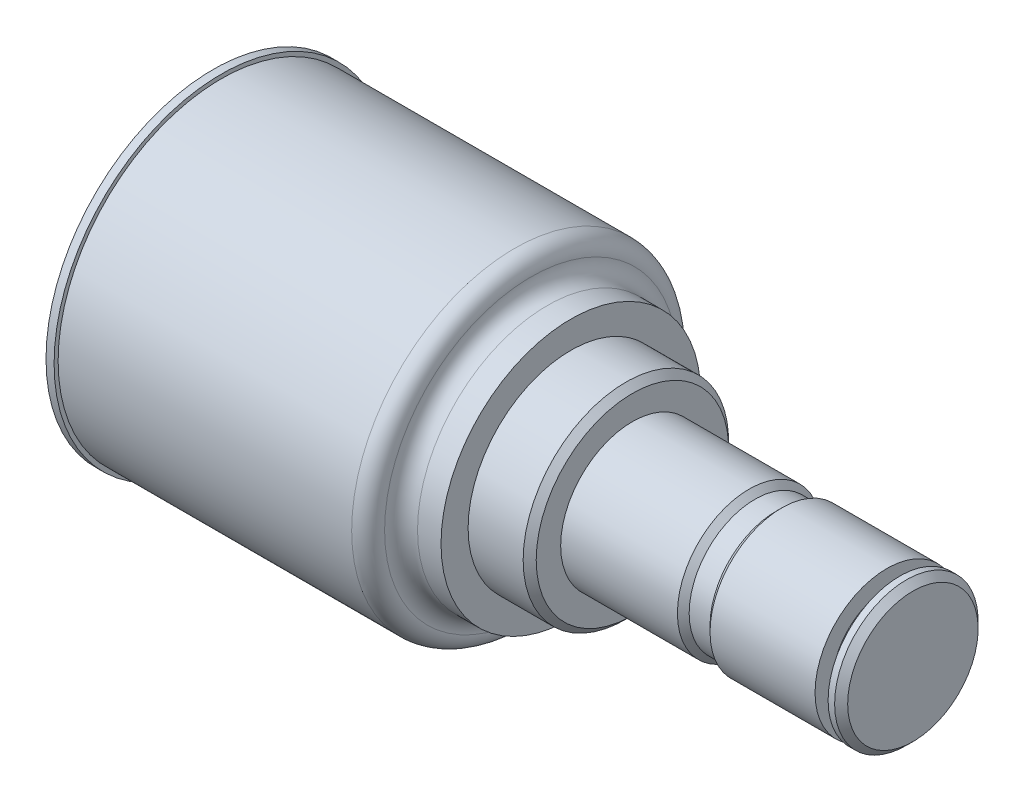
ISO-10303-21;
HEADER;
FILE_DESCRIPTION(('STEP AP214'),'2;1');
FILE_NAME('part.step','',(''),(''),'','','');
FILE_SCHEMA(('AUTOMOTIVE_DESIGN { 1 0 10303 214 1 1 1 1 }'));
ENDSEC;
DATA;
#1=APPLICATION_CONTEXT('core data for automotive mechanical design processes');
#2=APPLICATION_PROTOCOL_DEFINITION('international standard','automotive_design',2000,#1);
#3=PRODUCT_CONTEXT('',#1,'mechanical');
#4=PRODUCT('Part','Part','',(#3));
#5=PRODUCT_RELATED_PRODUCT_CATEGORY('part','',(#4));
#6=PRODUCT_DEFINITION_FORMATION('','',#4);
#7=PRODUCT_DEFINITION_CONTEXT('part definition',#1,'design');
#8=PRODUCT_DEFINITION('design','',#6,#7);
#9=PRODUCT_DEFINITION_SHAPE('','',#8);
#10=(LENGTH_UNIT() NAMED_UNIT(*) SI_UNIT(.MILLI.,.METRE.));
#11=(NAMED_UNIT(*) PLANE_ANGLE_UNIT() SI_UNIT($,.RADIAN.));
#12=(NAMED_UNIT(*) SI_UNIT($,.STERADIAN.) SOLID_ANGLE_UNIT());
#13=UNCERTAINTY_MEASURE_WITH_UNIT(LENGTH_MEASURE(1.E-05),#10,'distance_accuracy_value','');
#14=(GEOMETRIC_REPRESENTATION_CONTEXT(3) GLOBAL_UNCERTAINTY_ASSIGNED_CONTEXT((#13)) GLOBAL_UNIT_ASSIGNED_CONTEXT((#10,
#11,#12)) REPRESENTATION_CONTEXT('',''));
#15=CARTESIAN_POINT('',(0.,0.,0.));
#16=DIRECTION('',(0.,0.,1.));
#17=DIRECTION('',(1.,0.,0.));
#18=AXIS2_PLACEMENT_3D('',#15,#16,#17);
#19=CARTESIAN_POINT('',(136.2456,13.9700000000018,-2.22044604925031E-13));
#20=DIRECTION('',(-1.,0.,0.));
#21=DIRECTION('',(0.,0.,1.));
#22=AXIS2_PLACEMENT_3D('',#19,#20,#21);
#23=PLANE('',#22);
#24=CARTESIAN_POINT('',(136.2456,8.88178419700125E-13,0.));
#25=DIRECTION('',(-1.,0.,0.));
#26=DIRECTION('',(0.,0.,1.));
#27=AXIS2_PLACEMENT_3D('',#24,#25,#26);
#28=CIRCLE('',#27,12.7);
#29=CARTESIAN_POINT('',(136.2456,8.86768436458851E-13,12.7));
#30=VERTEX_POINT('',#29);
#31=EDGE_CURVE('E44',#30,#30,#28,.F.);
#32=ORIENTED_EDGE('',*,*,#31,.T.);
#33=EDGE_LOOP('',(#32));
#34=FACE_BOUND('',#33,.T.);
#35=ADVANCED_FACE('F33',(#34),#23,.F.);
#36=CARTESIAN_POINT('',(-9.33940457714594,-8.88178419700125E-13,0.));
#37=DIRECTION('',(-1.,0.,0.));
#38=DIRECTION('',(0.,0.,1.));
#39=AXIS2_PLACEMENT_3D('',#36,#37,#38);
#40=CYLINDRICAL_SURFACE('',#39,13.97);
#41=CARTESIAN_POINT('',(134.9756,0.,0.));
#42=DIRECTION('',(-1.,0.,0.));
#43=DIRECTION('',(0.,0.,1.));
#44=AXIS2_PLACEMENT_3D('',#41,#42,#43);
#45=CIRCLE('',#44,13.97);
#46=CARTESIAN_POINT('',(134.9756,0.,13.97));
#47=VERTEX_POINT('',#46);
#48=EDGE_CURVE('E48',#47,#47,#45,.T.);
#49=ORIENTED_EDGE('',*,*,#48,.T.);
#50=EDGE_LOOP('',(#49));
#51=FACE_BOUND('',#50,.T.);
#52=CARTESIAN_POINT('',(133.7056,0.,0.));
#53=DIRECTION('',(-1.,0.,0.));
#54=DIRECTION('',(0.,0.,1.));
#55=AXIS2_PLACEMENT_3D('',#52,#53,#54);
#56=CIRCLE('',#55,13.97);
#57=CARTESIAN_POINT('',(133.7056,0.,13.97));
#58=VERTEX_POINT('',#57);
#59=EDGE_CURVE('E53',#58,#58,#56,.T.);
#60=ORIENTED_EDGE('',*,*,#59,.F.);
#61=EDGE_LOOP('',(#60));
#62=FACE_BOUND('',#61,.T.);
#63=ADVANCED_FACE('F159',(#51,#62),#40,.T.);
#64=CARTESIAN_POINT('',(133.7056,10.5918000000003,4.44089209850063E-13));
#65=DIRECTION('',(1.,0.,0.));
#66=DIRECTION('',(0.,0.,-1.));
#67=AXIS2_PLACEMENT_3D('',#64,#65,#66);
#68=PLANE('',#67);
#69=CARTESIAN_POINT('',(133.7056,0.,0.));
#70=DIRECTION('',(-1.,0.,0.));
#71=DIRECTION('',(0.,0.,1.));
#72=AXIS2_PLACEMENT_3D('',#69,#70,#71);
#73=CIRCLE('',#72,10.5918);
#74=CARTESIAN_POINT('',(133.7056,0.,10.5918));
#75=VERTEX_POINT('',#74);
#76=EDGE_CURVE('E56',#75,#75,#73,.T.);
#77=ORIENTED_EDGE('',*,*,#76,.F.);
#78=EDGE_LOOP('',(#77));
#79=FACE_BOUND('',#78,.T.);
#80=ORIENTED_EDGE('',*,*,#59,.T.);
#81=EDGE_LOOP('',(#80));
#82=FACE_BOUND('',#81,.T.);
#83=ADVANCED_FACE('F165',(#79,#82),#68,.F.);
#84=CARTESIAN_POINT('',(-9.33940457714594,-8.88178419700125E-13,0.));
#85=DIRECTION('',(-1.,0.,0.));
#86=DIRECTION('',(0.,0.,1.));
#87=AXIS2_PLACEMENT_3D('',#84,#85,#86);
#88=CYLINDRICAL_SURFACE('',#87,10.5918);
#89=CARTESIAN_POINT('',(131.1656,0.,0.));
#90=DIRECTION('',(-1.,0.,0.));
#91=DIRECTION('',(0.,0.,1.));
#92=AXIS2_PLACEMENT_3D('',#89,#90,#91);
#93=CIRCLE('',#92,10.5918);
#94=CARTESIAN_POINT('',(131.1656,0.,10.5918));
#95=VERTEX_POINT('',#94);
#96=EDGE_CURVE('E59',#95,#95,#93,.T.);
#97=ORIENTED_EDGE('',*,*,#96,.F.);
#98=EDGE_LOOP('',(#97));
#99=FACE_BOUND('',#98,.T.);
#100=ORIENTED_EDGE('',*,*,#76,.T.);
#101=EDGE_LOOP('',(#100));
#102=FACE_BOUND('',#101,.T.);
#103=ADVANCED_FACE('F185',(#99,#102),#88,.T.);
#104=CARTESIAN_POINT('',(131.1656,13.9699999999991,-2.22044604925031E-13));
#105=DIRECTION('',(-1.,0.,0.));
#106=DIRECTION('',(0.,0.,1.));
#107=AXIS2_PLACEMENT_3D('',#104,#105,#106);
#108=PLANE('',#107);
#109=CARTESIAN_POINT('',(131.1656,0.,0.));
#110=DIRECTION('',(-1.,0.,0.));
#111=DIRECTION('',(0.,0.,1.));
#112=AXIS2_PLACEMENT_3D('',#109,#110,#111);
#113=CIRCLE('',#112,13.97);
#114=CARTESIAN_POINT('',(131.1656,0.,13.97));
#115=VERTEX_POINT('',#114);
#116=EDGE_CURVE('E62',#115,#115,#113,.T.);
#117=ORIENTED_EDGE('',*,*,#116,.F.);
#118=EDGE_LOOP('',(#117));
#119=FACE_BOUND('',#118,.T.);
#120=ORIENTED_EDGE('',*,*,#96,.T.);
#121=EDGE_LOOP('',(#120));
#122=FACE_BOUND('',#121,.T.);
#123=ADVANCED_FACE('F190',(#119,#122),#108,.F.);
#124=CARTESIAN_POINT('',(-9.33940457714594,-8.88178419700125E-13,0.));
#125=DIRECTION('',(-1.,0.,0.));
#126=DIRECTION('',(0.,0.,1.));
#127=AXIS2_PLACEMENT_3D('',#124,#125,#126);
#128=CYLINDRICAL_SURFACE('',#127,13.97);
#129=CARTESIAN_POINT('',(110.7186,0.,-4.44089209850063E-13));
#130=DIRECTION('',(-1.,0.,0.));
#131=DIRECTION('',(0.,0.,1.));
#132=AXIS2_PLACEMENT_3D('',#129,#130,#131);
#133=CIRCLE('',#132,13.97);
#134=CARTESIAN_POINT('',(110.7186,0.,13.9699999999996));
#135=VERTEX_POINT('',#134);
#136=EDGE_CURVE('E65',#135,#135,#133,.T.);
#137=ORIENTED_EDGE('',*,*,#136,.F.);
#138=EDGE_LOOP('',(#137));
#139=FACE_BOUND('',#138,.T.);
#140=ORIENTED_EDGE('',*,*,#116,.T.);
#141=EDGE_LOOP('',(#140));
#142=FACE_BOUND('',#141,.T.);
#143=ADVANCED_FACE('F197',(#139,#142),#128,.T.);
#144=CARTESIAN_POINT('',(110.7186,0.,-4.44089209850063E-13));
#145=DIRECTION('',(1.,0.,0.));
#146=DIRECTION('',(0.,0.,-1.));
#147=AXIS2_PLACEMENT_3D('',#144,#145,#146);
#148=CONICAL_SURFACE('',#147,13.97,0.785398163397447);
#149=CARTESIAN_POINT('',(109.5756,0.,-4.44089209850063E-13));
#150=DIRECTION('',(-1.,0.,0.));
#151=DIRECTION('',(0.,0.,1.));
#152=AXIS2_PLACEMENT_3D('',#149,#150,#151);
#153=CIRCLE('',#152,12.827);
#154=CARTESIAN_POINT('',(109.5756,0.,12.8269999999996));
#155=VERTEX_POINT('',#154);
#156=EDGE_CURVE('E68',#155,#155,#153,.T.);
#157=ORIENTED_EDGE('',*,*,#156,.F.);
#158=EDGE_LOOP('',(#157));
#159=FACE_BOUND('',#158,.T.);
#160=ORIENTED_EDGE('',*,*,#136,.T.);
#161=EDGE_LOOP('',(#160));
#162=FACE_BOUND('',#161,.T.);
#163=ADVANCED_FACE('F201',(#159,#162),#148,.T.);
#164=CARTESIAN_POINT('',(-9.33940457714594,-8.88178419700125E-13,0.));
#165=DIRECTION('',(-1.,0.,0.));
#166=DIRECTION('',(0.,0.,1.));
#167=AXIS2_PLACEMENT_3D('',#164,#165,#166);
#168=CYLINDRICAL_SURFACE('',#167,12.827);
#169=CARTESIAN_POINT('',(105.5116,4.44089209850063E-13,-2.22044604925031E-13));
#170=DIRECTION('',(-1.,0.,0.));
#171=DIRECTION('',(0.,0.,1.));
#172=AXIS2_PLACEMENT_3D('',#169,#170,#171);
#173=CIRCLE('',#172,12.827);
#174=CARTESIAN_POINT('',(105.5116,4.42665126776375E-13,12.8269999999998));
#175=VERTEX_POINT('',#174);
#176=EDGE_CURVE('E71',#175,#175,#173,.T.);
#177=ORIENTED_EDGE('',*,*,#176,.F.);
#178=EDGE_LOOP('',(#177));
#179=FACE_BOUND('',#178,.T.);
#180=ORIENTED_EDGE('',*,*,#156,.T.);
#181=EDGE_LOOP('',(#180));
#182=FACE_BOUND('',#181,.T.);
#183=ADVANCED_FACE('F205',(#179,#182),#168,.T.);
#184=CARTESIAN_POINT('',(105.5116,4.44089209850063E-13,-2.22044604925031E-13));
#185=DIRECTION('',(-1.,0.,0.));
#186=DIRECTION('',(0.,0.,1.));
#187=AXIS2_PLACEMENT_3D('',#184,#185,#186);
#188=CONICAL_SURFACE('',#187,12.827,0.785398163397453);
#189=CARTESIAN_POINT('',(104.3686,4.44089209850063E-13,-2.22044604925031E-13));
#190=DIRECTION('',(-1.,0.,0.));
#191=DIRECTION('',(0.,0.,1.));
#192=AXIS2_PLACEMENT_3D('',#189,#190,#191);
#193=CIRCLE('',#192,13.97);
#194=CARTESIAN_POINT('',(104.3686,4.42538228284661E-13,13.9699999999998));
#195=VERTEX_POINT('',#194);
#196=EDGE_CURVE('E74',#195,#195,#193,.T.);
#197=ORIENTED_EDGE('',*,*,#196,.F.);
#198=EDGE_LOOP('',(#197));
#199=FACE_BOUND('',#198,.T.);
#200=ORIENTED_EDGE('',*,*,#176,.T.);
#201=EDGE_LOOP('',(#200));
#202=FACE_BOUND('',#201,.T.);
#203=ADVANCED_FACE('F209',(#199,#202),#188,.T.);
#204=CARTESIAN_POINT('',(-9.33940457714594,-8.88178419700125E-13,0.));
#205=DIRECTION('',(-1.,0.,0.));
#206=DIRECTION('',(0.,0.,1.));
#207=AXIS2_PLACEMENT_3D('',#204,#205,#206);
#208=CYLINDRICAL_SURFACE('',#207,13.97);
#209=CARTESIAN_POINT('',(81.6356,-4.44089209850063E-13,0.));
#210=DIRECTION('',(-1.,0.,0.));
#211=DIRECTION('',(0.,0.,1.));
#212=AXIS2_PLACEMENT_3D('',#209,#210,#211);
#213=CIRCLE('',#212,13.97);
#214=CARTESIAN_POINT('',(81.6356,-4.45640191415464E-13,13.97));
#215=VERTEX_POINT('',#214);
#216=EDGE_CURVE('E77',#215,#215,#213,.T.);
#217=ORIENTED_EDGE('',*,*,#216,.F.);
#218=EDGE_LOOP('',(#217));
#219=FACE_BOUND('',#218,.T.);
#220=ORIENTED_EDGE('',*,*,#196,.T.);
#221=EDGE_LOOP('',(#220));
#222=FACE_BOUND('',#221,.T.);
#223=ADVANCED_FACE('F156',(#219,#222),#208,.T.);
#224=CARTESIAN_POINT('',(81.6356000000001,20.002499999999,-2.22044604925031E-13));
#225=DIRECTION('',(-1.,0.,0.));
#226=DIRECTION('',(0.,0.,1.));
#227=AXIS2_PLACEMENT_3D('',#224,#225,#226);
#228=PLANE('',#227);
#229=CARTESIAN_POINT('',(81.6356,-4.44089209850063E-13,0.));
#230=DIRECTION('',(-1.,0.,0.));
#231=DIRECTION('',(0.,0.,1.));
#232=AXIS2_PLACEMENT_3D('',#229,#230,#231);
#233=CIRCLE('',#232,18.7325);
#234=CARTESIAN_POINT('',(81.6356,-4.46168935130942E-13,18.7325));
#235=VERTEX_POINT('',#234);
#236=EDGE_CURVE('E10',#235,#235,#233,.F.);
#237=ORIENTED_EDGE('',*,*,#236,.T.);
#238=EDGE_LOOP('',(#237));
#239=FACE_BOUND('',#238,.T.);
#240=ORIENTED_EDGE('',*,*,#216,.T.);
#241=EDGE_LOOP('',(#240));
#242=FACE_BOUND('',#241,.T.);
#243=ADVANCED_FACE('F151',(#239,#242),#228,.F.);
#244=CARTESIAN_POINT('',(-9.33940457714594,-8.88178419700125E-13,0.));
#245=DIRECTION('',(-1.,0.,0.));
#246=DIRECTION('',(0.,0.,1.));
#247=AXIS2_PLACEMENT_3D('',#244,#245,#246);
#248=CYLINDRICAL_SURFACE('',#247,20.0025);
#249=CARTESIAN_POINT('',(80.3656,-4.44089209850063E-13,0.));
#250=DIRECTION('',(-1.,0.,0.));
#251=DIRECTION('',(0.,0.,1.));
#252=AXIS2_PLACEMENT_3D('',#249,#250,#251);
#253=CIRCLE('',#252,20.0025);
#254=CARTESIAN_POINT('',(80.3656,-4.4630993345507E-13,20.0025));
#255=VERTEX_POINT('',#254);
#256=EDGE_CURVE('E40',#255,#255,#253,.T.);
#257=ORIENTED_EDGE('',*,*,#256,.T.);
#258=EDGE_LOOP('',(#257));
#259=FACE_BOUND('',#258,.T.);
#260=CARTESIAN_POINT('',(69.6468,0.,-4.44089209850063E-13));
#261=DIRECTION('',(-1.,0.,0.));
#262=DIRECTION('',(0.,0.,1.));
#263=AXIS2_PLACEMENT_3D('',#260,#261,#262);
#264=CIRCLE('',#263,20.0025);
#265=CARTESIAN_POINT('',(69.6468,0.,20.0024999999996));
#266=VERTEX_POINT('',#265);
#267=EDGE_CURVE('E80',#266,#266,#264,.T.);
#268=ORIENTED_EDGE('',*,*,#267,.F.);
#269=EDGE_LOOP('',(#268));
#270=FACE_BOUND('',#269,.T.);
#271=ADVANCED_FACE('F146',(#259,#270),#248,.T.);
#272=CARTESIAN_POINT('',(69.6468,25.27485011526,0.));
#273=DIRECTION('',(-1.,0.,0.));
#274=DIRECTION('',(0.,0.,1.));
#275=AXIS2_PLACEMENT_3D('',#272,#273,#274);
#276=PLANE('',#275);
#277=CARTESIAN_POINT('',(69.6468,0.,-4.44089209850063E-13));
#278=DIRECTION('',(-1.,0.,0.));
#279=DIRECTION('',(0.,0.,1.));
#280=AXIS2_PLACEMENT_3D('',#277,#278,#279);
#281=CIRCLE('',#280,25.2748501152599);
#282=CARTESIAN_POINT('',(69.6468,0.,25.2748501152595));
#283=VERTEX_POINT('',#282);
#284=EDGE_CURVE('E83',#283,#283,#281,.T.);
#285=ORIENTED_EDGE('',*,*,#284,.F.);
#286=EDGE_LOOP('',(#285));
#287=FACE_BOUND('',#286,.T.);
#288=ORIENTED_EDGE('',*,*,#267,.T.);
#289=EDGE_LOOP('',(#288));
#290=FACE_BOUND('',#289,.T.);
#291=ADVANCED_FACE('F140',(#287,#290),#276,.F.);
#292=CARTESIAN_POINT('',(-9.33940457714594,-8.88178419700125E-13,0.));
#293=DIRECTION('',(-1.,0.,0.));
#294=DIRECTION('',(0.,0.,1.));
#295=AXIS2_PLACEMENT_3D('',#292,#293,#294);
#296=CYLINDRICAL_SURFACE('',#295,25.2748501152599);
#297=CARTESIAN_POINT('',(65.0735666130005,0.,-4.44089209850063E-13));
#298=DIRECTION('',(-1.,0.,0.));
#299=DIRECTION('',(0.,0.,1.));
#300=AXIS2_PLACEMENT_3D('',#297,#298,#299);
#301=CIRCLE('',#300,25.2748501152599);
#302=CARTESIAN_POINT('',(65.0735666130005,0.,25.2748501152595));
#303=VERTEX_POINT('',#302);
#304=EDGE_CURVE('E86',#303,#303,#301,.T.);
#305=ORIENTED_EDGE('',*,*,#304,.F.);
#306=EDGE_LOOP('',(#305));
#307=FACE_BOUND('',#306,.T.);
#308=ORIENTED_EDGE('',*,*,#284,.T.);
#309=EDGE_LOOP('',(#308));
#310=FACE_BOUND('',#309,.T.);
#311=ADVANCED_FACE('F134',(#307,#310),#296,.T.);
#312=CARTESIAN_POINT('',(65.0735666130005,0.,-4.44089209850063E-13));
#313=DIRECTION('',(-1.,0.,0.));
#314=DIRECTION('',(0.,0.,1.));
#315=AXIS2_PLACEMENT_3D('',#312,#313,#314);
#316=TOROIDAL_SURFACE('',#315,28.4498501152599,3.175);
#317=CARTESIAN_POINT('',(61.8991833065002,8.88178419700125E-13,-2.22044604925031E-13));
#318=DIRECTION('',(-1.,0.,0.));
#319=DIRECTION('',(0.,0.,1.));
#320=AXIS2_PLACEMENT_3D('',#317,#318,#319);
#321=CIRCLE('',#320,28.5124250576299);
#322=CARTESIAN_POINT('',(61.8991833065002,8.85012904621436E-13,28.5124250576298));
#323=VERTEX_POINT('',#322);
#324=EDGE_CURVE('E89',#323,#323,#321,.T.);
#325=ORIENTED_EDGE('',*,*,#324,.F.);
#326=EDGE_LOOP('',(#325));
#327=FACE_BOUND('',#326,.T.);
#328=ORIENTED_EDGE('',*,*,#304,.T.);
#329=EDGE_LOOP('',(#328));
#330=FACE_BOUND('',#329,.T.);
#331=ADVANCED_FACE('F128',(#327,#330),#316,.F.);
#332=CARTESIAN_POINT('',(58.7248,8.88178419700125E-13,-2.22044604925031E-13));
#333=DIRECTION('',(-1.,0.,0.));
#334=DIRECTION('',(0.,0.,1.));
#335=AXIS2_PLACEMENT_3D('',#332,#333,#334);
#336=TOROIDAL_SURFACE('',#335,28.575,3.175);
#337=CARTESIAN_POINT('',(58.7248,8.88178419700125E-13,-2.22044604925031E-13));
#338=DIRECTION('',(-1.,0.,0.));
#339=DIRECTION('',(0.,0.,1.));
#340=AXIS2_PLACEMENT_3D('',#337,#338,#339);
#341=CIRCLE('',#340,31.75);
#342=CARTESIAN_POINT('',(58.7248,8.84653461596939E-13,31.7499999999998));
#343=VERTEX_POINT('',#342);
#344=EDGE_CURVE('E92',#343,#343,#341,.T.);
#345=ORIENTED_EDGE('',*,*,#344,.F.);
#346=EDGE_LOOP('',(#345));
#347=FACE_BOUND('',#346,.T.);
#348=ORIENTED_EDGE('',*,*,#324,.T.);
#349=EDGE_LOOP('',(#348));
#350=FACE_BOUND('',#349,.T.);
#351=ADVANCED_FACE('F122',(#347,#350),#336,.T.);
#352=CARTESIAN_POINT('',(-9.33940457714594,-8.88178419700125E-13,0.));
#353=DIRECTION('',(-1.,0.,0.));
#354=DIRECTION('',(0.,0.,1.));
#355=AXIS2_PLACEMENT_3D('',#352,#353,#354);
#356=CYLINDRICAL_SURFACE('',#355,31.75);
#357=CARTESIAN_POINT('',(1.57479999999999,8.88178419700125E-13,0.));
#358=DIRECTION('',(-1.,0.,0.));
#359=DIRECTION('',(0.,0.,1.));
#360=AXIS2_PLACEMENT_3D('',#357,#358,#359);
#361=CIRCLE('',#360,31.75);
#362=CARTESIAN_POINT('',(1.57479999999999,8.84653461596939E-13,31.7500000000001));
#363=VERTEX_POINT('',#362);
#364=EDGE_CURVE('E95',#363,#363,#361,.T.);
#365=ORIENTED_EDGE('',*,*,#364,.F.);
#366=EDGE_LOOP('',(#365));
#367=FACE_BOUND('',#366,.T.);
#368=ORIENTED_EDGE('',*,*,#344,.T.);
#369=EDGE_LOOP('',(#368));
#370=FACE_BOUND('',#369,.T.);
#371=ADVANCED_FACE('F116',(#367,#370),#356,.T.);
#372=CARTESIAN_POINT('',(1.5748000000001,32.5374000000007,0.));
#373=DIRECTION('',(-1.,0.,0.));
#374=DIRECTION('',(0.,0.,1.));
#375=AXIS2_PLACEMENT_3D('',#372,#373,#374);
#376=PLANE('',#375);
#377=CARTESIAN_POINT('',(1.57479999999999,8.88178419700125E-13,0.));
#378=DIRECTION('',(-1.,0.,0.));
#379=DIRECTION('',(0.,0.,1.));
#380=AXIS2_PLACEMENT_3D('',#377,#378,#379);
#381=CIRCLE('',#380,32.5374);
#382=CARTESIAN_POINT('',(1.57479999999999,8.8456604263598E-13,32.5374));
#383=VERTEX_POINT('',#382);
#384=EDGE_CURVE('E98',#383,#383,#381,.T.);
#385=ORIENTED_EDGE('',*,*,#384,.F.);
#386=EDGE_LOOP('',(#385));
#387=FACE_BOUND('',#386,.T.);
#388=ORIENTED_EDGE('',*,*,#364,.T.);
#389=EDGE_LOOP('',(#388));
#390=FACE_BOUND('',#389,.T.);
#391=ADVANCED_FACE('F110',(#387,#390),#376,.F.);
#392=CARTESIAN_POINT('',(-9.33940457714594,-8.88178419700125E-13,0.));
#393=DIRECTION('',(-1.,0.,0.));
#394=DIRECTION('',(0.,0.,1.));
#395=AXIS2_PLACEMENT_3D('',#392,#393,#394);
#396=CYLINDRICAL_SURFACE('',#395,32.5374);
#397=CARTESIAN_POINT('',(0.,0.,0.));
#398=DIRECTION('',(-1.,0.,0.));
#399=DIRECTION('',(0.,0.,1.));
#400=AXIS2_PLACEMENT_3D('',#397,#398,#399);
#401=CIRCLE('',#400,32.5374);
#402=CARTESIAN_POINT('',(0.,0.,32.5374));
#403=VERTEX_POINT('',#402);
#404=EDGE_CURVE('E101',#403,#403,#401,.T.);
#405=ORIENTED_EDGE('',*,*,#404,.F.);
#406=EDGE_LOOP('',(#405));
#407=FACE_BOUND('',#406,.T.);
#408=ORIENTED_EDGE('',*,*,#384,.T.);
#409=EDGE_LOOP('',(#408));
#410=FACE_BOUND('',#409,.T.);
#411=ADVANCED_FACE('F107',(#407,#410),#396,.T.);
#412=CARTESIAN_POINT('',(0.,0.,0.));
#413=DIRECTION('',(1.,0.,0.));
#414=DIRECTION('',(0.,0.,-1.));
#415=AXIS2_PLACEMENT_3D('',#412,#413,#414);
#416=PLANE('',#415);
#417=ORIENTED_EDGE('',*,*,#404,.T.);
#418=EDGE_LOOP('',(#417));
#419=FACE_BOUND('',#418,.T.);
#420=ADVANCED_FACE('F105',(#419),#416,.F.);
#421=CARTESIAN_POINT('',(134.9756,0.,0.));
#422=DIRECTION('',(-1.,0.,0.));
#423=DIRECTION('',(0.,0.,1.));
#424=AXIS2_PLACEMENT_3D('',#421,#422,#423);
#425=CONICAL_SURFACE('',#424,13.97,0.78539816339745);
#426=ORIENTED_EDGE('',*,*,#31,.F.);
#427=EDGE_LOOP('',(#426));
#428=FACE_BOUND('',#427,.T.);
#429=ORIENTED_EDGE('',*,*,#48,.F.);
#430=EDGE_LOOP('',(#429));
#431=FACE_BOUND('',#430,.T.);
#432=ADVANCED_FACE('F169',(#428,#431),#425,.T.);
#433=CARTESIAN_POINT('',(80.3656,-4.44089209850063E-13,0.));
#434=DIRECTION('',(-1.,0.,0.));
#435=DIRECTION('',(0.,0.,1.));
#436=AXIS2_PLACEMENT_3D('',#433,#434,#435);
#437=CONICAL_SURFACE('',#436,20.0025,0.785398163397451);
#438=ORIENTED_EDGE('',*,*,#236,.F.);
#439=EDGE_LOOP('',(#438));
#440=FACE_BOUND('',#439,.T.);
#441=ORIENTED_EDGE('',*,*,#256,.F.);
#442=EDGE_LOOP('',(#441));
#443=FACE_BOUND('',#442,.T.);
#444=ADVANCED_FACE('F35',(#440,#443),#437,.T.);
#445=CLOSED_SHELL('',(#35,#63,#83,#103,#123,#143,#163,#183,#203,#223,#243,#271,#291,#311,#331,
#351,#371,#391,#411,#420,#432,#444));
#446=MANIFOLD_SOLID_BREP('B2',#445);
#447=ADVANCED_BREP_SHAPE_REPRESENTATION('',(#18,#446),#14);
#448=SHAPE_DEFINITION_REPRESENTATION(#9,#447);
ENDSEC;
END-ISO-10303-21;
